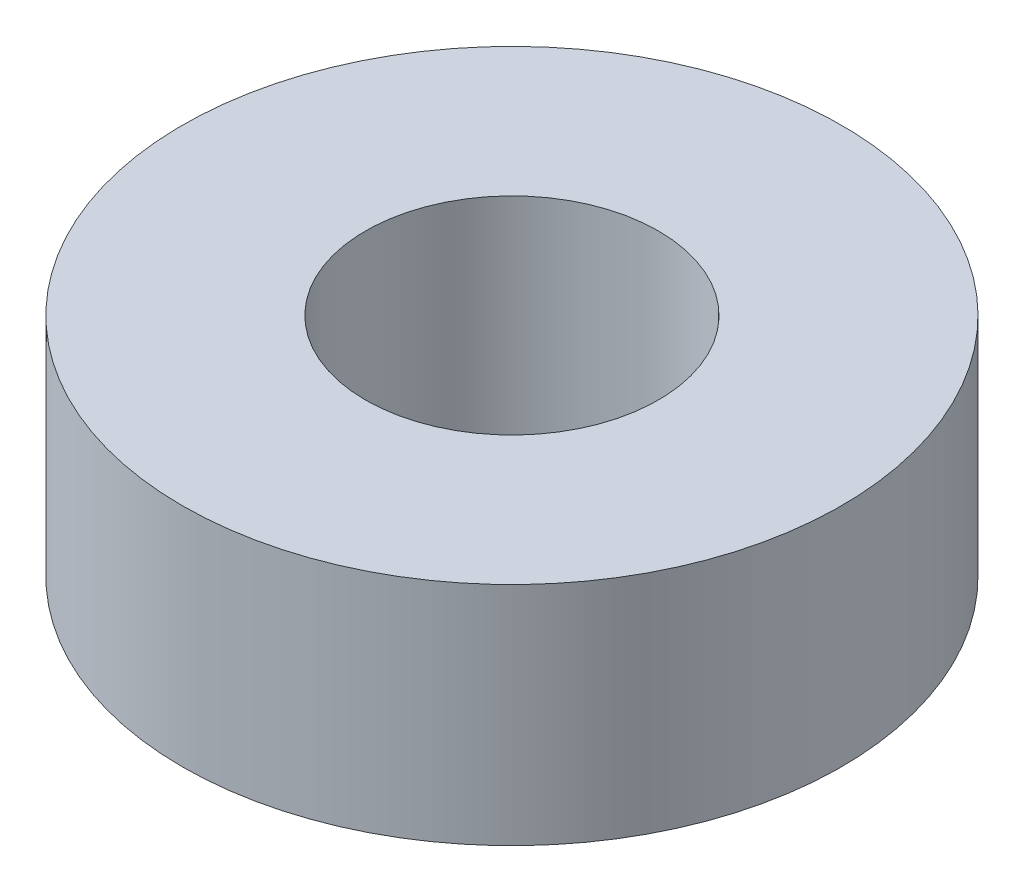
ISO-10303-21;
HEADER;
FILE_DESCRIPTION(('STEP AP214'),'2;1');
FILE_NAME('part.step','',(''),(''),'','','');
FILE_SCHEMA(('AUTOMOTIVE_DESIGN { 1 0 10303 214 1 1 1 1 }'));
ENDSEC;
DATA;
#1=APPLICATION_CONTEXT('core data for automotive mechanical design processes');
#2=APPLICATION_PROTOCOL_DEFINITION('international standard','automotive_design',2000,#1);
#3=PRODUCT_CONTEXT('',#1,'mechanical');
#4=PRODUCT('Part','Part','',(#3));
#5=PRODUCT_RELATED_PRODUCT_CATEGORY('part','',(#4));
#6=PRODUCT_DEFINITION_FORMATION('','',#4);
#7=PRODUCT_DEFINITION_CONTEXT('part definition',#1,'design');
#8=PRODUCT_DEFINITION('design','',#6,#7);
#9=PRODUCT_DEFINITION_SHAPE('','',#8);
#10=(LENGTH_UNIT() NAMED_UNIT(*) SI_UNIT(.MILLI.,.METRE.));
#11=(NAMED_UNIT(*) PLANE_ANGLE_UNIT() SI_UNIT($,.RADIAN.));
#12=(NAMED_UNIT(*) SI_UNIT($,.STERADIAN.) SOLID_ANGLE_UNIT());
#13=UNCERTAINTY_MEASURE_WITH_UNIT(LENGTH_MEASURE(1.E-05),#10,'distance_accuracy_value','');
#14=(GEOMETRIC_REPRESENTATION_CONTEXT(3) GLOBAL_UNCERTAINTY_ASSIGNED_CONTEXT((#13)) GLOBAL_UNIT_ASSIGNED_CONTEXT((#10,
#11,#12)) REPRESENTATION_CONTEXT('',''));
#15=CARTESIAN_POINT('',(0.,0.,0.));
#16=DIRECTION('',(0.,0.,1.));
#17=DIRECTION('',(1.,0.,0.));
#18=AXIS2_PLACEMENT_3D('',#15,#16,#17);
#19=CARTESIAN_POINT('',(0.,4.9022,0.));
#20=DIRECTION('',(0.,1.,0.));
#21=DIRECTION('',(0.,0.,1.));
#22=AXIS2_PLACEMENT_3D('',#19,#20,#21);
#23=PLANE('',#22);
#24=CARTESIAN_POINT('',(0.,4.9022,0.));
#25=DIRECTION('',(0.,1.,0.));
#26=DIRECTION('',(0.,0.,1.));
#27=AXIS2_PLACEMENT_3D('',#24,#25,#26);
#28=CIRCLE('',#27,7.14375);
#29=CARTESIAN_POINT('',(0.,4.9022,7.14375));
#30=VERTEX_POINT('',#29);
#31=EDGE_CURVE('E10',#30,#30,#28,.T.);
#32=ORIENTED_EDGE('',*,*,#31,.T.);
#33=EDGE_LOOP('',(#32));
#34=FACE_BOUND('',#33,.T.);
#35=CARTESIAN_POINT('',(0.,4.9022,0.));
#36=DIRECTION('',(0.,1.,0.));
#37=DIRECTION('',(0.,0.,1.));
#38=AXIS2_PLACEMENT_3D('',#35,#36,#37);
#39=CIRCLE('',#38,3.175);
#40=CARTESIAN_POINT('',(0.,4.9022,3.175));
#41=VERTEX_POINT('',#40);
#42=EDGE_CURVE('E369',#41,#41,#39,.T.);
#43=ORIENTED_EDGE('',*,*,#42,.F.);
#44=EDGE_LOOP('',(#43));
#45=FACE_BOUND('',#44,.T.);
#46=ADVANCED_FACE('F358',(#34,#45),#23,.T.);
#47=CARTESIAN_POINT('',(0.,0.,0.));
#48=DIRECTION('',(0.,1.,0.));
#49=DIRECTION('',(0.,0.,1.));
#50=AXIS2_PLACEMENT_3D('',#47,#48,#49);
#51=PLANE('',#50);
#52=CARTESIAN_POINT('',(0.,0.,0.));
#53=DIRECTION('',(0.,1.,0.));
#54=DIRECTION('',(0.,0.,1.));
#55=AXIS2_PLACEMENT_3D('',#52,#53,#54);
#56=CIRCLE('',#55,7.14375);
#57=CARTESIAN_POINT('',(0.,0.,7.14375));
#58=VERTEX_POINT('',#57);
#59=EDGE_CURVE('E365',#58,#58,#56,.T.);
#60=ORIENTED_EDGE('',*,*,#59,.F.);
#61=EDGE_LOOP('',(#60));
#62=FACE_BOUND('',#61,.T.);
#63=CARTESIAN_POINT('',(0.,0.,0.));
#64=DIRECTION('',(0.,1.,0.));
#65=DIRECTION('',(0.,0.,1.));
#66=AXIS2_PLACEMENT_3D('',#63,#64,#65);
#67=CIRCLE('',#66,3.175);
#68=CARTESIAN_POINT('',(0.,0.,3.175));
#69=VERTEX_POINT('',#68);
#70=EDGE_CURVE('E373',#69,#69,#67,.T.);
#71=ORIENTED_EDGE('',*,*,#70,.T.);
#72=EDGE_LOOP('',(#71));
#73=FACE_BOUND('',#72,.T.);
#74=ADVANCED_FACE('F379',(#62,#73),#51,.F.);
#75=CARTESIAN_POINT('',(0.,4.9022,0.));
#76=DIRECTION('',(0.,-1.,0.));
#77=DIRECTION('',(0.,0.,-1.));
#78=AXIS2_PLACEMENT_3D('',#75,#76,#77);
#79=CYLINDRICAL_SURFACE('',#78,7.14375);
#80=ORIENTED_EDGE('',*,*,#31,.F.);
#81=EDGE_LOOP('',(#80));
#82=FACE_BOUND('',#81,.T.);
#83=ORIENTED_EDGE('',*,*,#59,.T.);
#84=EDGE_LOOP('',(#83));
#85=FACE_BOUND('',#84,.T.);
#86=ADVANCED_FACE('F360',(#82,#85),#79,.T.);
#87=CARTESIAN_POINT('',(0.,4.9022,0.));
#88=DIRECTION('',(0.,-1.,0.));
#89=DIRECTION('',(0.,0.,-1.));
#90=AXIS2_PLACEMENT_3D('',#87,#88,#89);
#91=CYLINDRICAL_SURFACE('',#90,3.175);
#92=ORIENTED_EDGE('',*,*,#42,.T.);
#93=EDGE_LOOP('',(#92));
#94=FACE_BOUND('',#93,.T.);
#95=ORIENTED_EDGE('',*,*,#70,.F.);
#96=EDGE_LOOP('',(#95));
#97=FACE_BOUND('',#96,.T.);
#98=ADVANCED_FACE('F381',(#94,#97),#91,.F.);
#99=CLOSED_SHELL('',(#46,#74,#86,#98));
#100=MANIFOLD_SOLID_BREP('B2',#99);
#101=ADVANCED_BREP_SHAPE_REPRESENTATION('',(#18,#100),#14);
#102=SHAPE_DEFINITION_REPRESENTATION(#9,#101);
ENDSEC;
END-ISO-10303-21;
